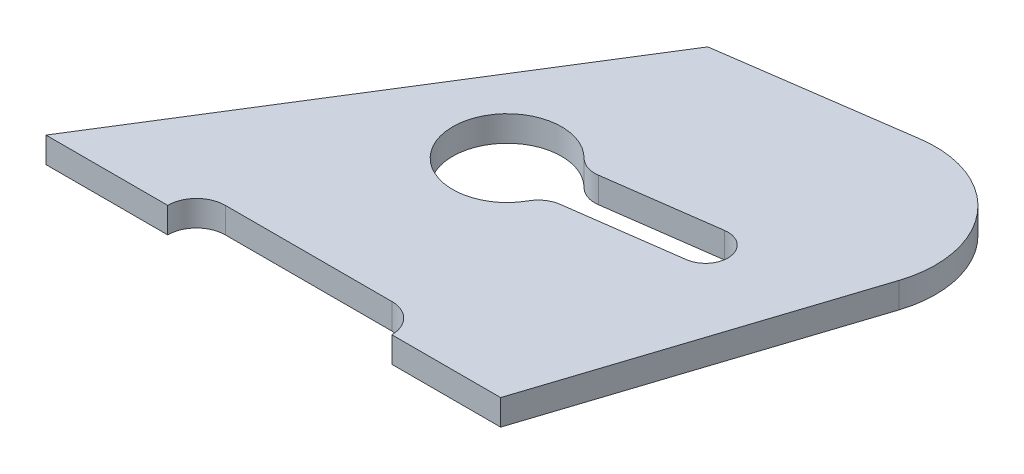
ISO-10303-21;
HEADER;
FILE_DESCRIPTION(('STEP AP214'),'2;1');
FILE_NAME('part.step','',(''),(''),'','','');
FILE_SCHEMA(('AUTOMOTIVE_DESIGN { 1 0 10303 214 1 1 1 1 }'));
ENDSEC;
DATA;
#1=APPLICATION_CONTEXT('core data for automotive mechanical design processes');
#2=APPLICATION_PROTOCOL_DEFINITION('international standard','automotive_design',2000,#1);
#3=PRODUCT_CONTEXT('',#1,'mechanical');
#4=PRODUCT('Part','Part','',(#3));
#5=PRODUCT_RELATED_PRODUCT_CATEGORY('part','',(#4));
#6=PRODUCT_DEFINITION_FORMATION('','',#4);
#7=PRODUCT_DEFINITION_CONTEXT('part definition',#1,'design');
#8=PRODUCT_DEFINITION('design','',#6,#7);
#9=PRODUCT_DEFINITION_SHAPE('','',#8);
#10=(LENGTH_UNIT() NAMED_UNIT(*) SI_UNIT(.MILLI.,.METRE.));
#11=(NAMED_UNIT(*) PLANE_ANGLE_UNIT() SI_UNIT($,.RADIAN.));
#12=(NAMED_UNIT(*) SI_UNIT($,.STERADIAN.) SOLID_ANGLE_UNIT());
#13=UNCERTAINTY_MEASURE_WITH_UNIT(LENGTH_MEASURE(1.E-05),#10,'distance_accuracy_value','');
#14=(GEOMETRIC_REPRESENTATION_CONTEXT(3) GLOBAL_UNCERTAINTY_ASSIGNED_CONTEXT((#13)) GLOBAL_UNIT_ASSIGNED_CONTEXT((#10,
#11,#12)) REPRESENTATION_CONTEXT('',''));
#15=CARTESIAN_POINT('',(0.,0.,0.));
#16=DIRECTION('',(0.,0.,1.));
#17=DIRECTION('',(1.,0.,0.));
#18=AXIS2_PLACEMENT_3D('',#15,#16,#17);
#19=CARTESIAN_POINT('',(142.06973961903,8.,-103.768811757372));
#20=DIRECTION('',(0.,1.,0.));
#21=DIRECTION('',(0.,0.,1.));
#22=AXIS2_PLACEMENT_3D('',#19,#20,#21);
#23=PLANE('',#22);
#24=DIRECTION('',(-0.529919264233203,0.,0.848048096156428));
#25=VECTOR('',#24,1.);
#26=CARTESIAN_POINT('',(0.,8.,0.));
#27=LINE('',#26,#25);
#28=CARTESIAN_POINT('',(79.4878896349804,8.,-127.207214423464));
#29=VERTEX_POINT('',#28);
#30=CARTESIAN_POINT('',(0.,8.,0.));
#31=VERTEX_POINT('',#30);
#32=EDGE_CURVE('E220',#29,#31,#27,.T.);
#33=ORIENTED_EDGE('',*,*,#32,.T.);
#34=DIRECTION('',(1.,0.,0.));
#35=VECTOR('',#34,1.);
#36=CARTESIAN_POINT('',(0.,8.,0.));
#37=LINE('',#36,#35);
#38=CARTESIAN_POINT('',(38.,8.,0.));
#39=VERTEX_POINT('',#38);
#40=EDGE_CURVE('E224',#31,#39,#37,.T.);
#41=ORIENTED_EDGE('',*,*,#40,.T.);
#42=CARTESIAN_POINT('',(47.,8.,0.));
#43=DIRECTION('',(0.,-1.,0.));
#44=DIRECTION('',(0.,0.,1.));
#45=AXIS2_PLACEMENT_3D('',#42,#43,#44);
#46=CIRCLE('',#45,9.);
#47=CARTESIAN_POINT('',(47.,8.,-9.));
#48=VERTEX_POINT('',#47);
#49=EDGE_CURVE('E228',#39,#48,#46,.T.);
#50=ORIENTED_EDGE('',*,*,#49,.T.);
#51=DIRECTION('',(1.,0.,0.));
#52=VECTOR('',#51,1.);
#53=CARTESIAN_POINT('',(47.,8.,-9.));
#54=LINE('',#53,#52);
#55=CARTESIAN_POINT('',(99.,8.,-9.));
#56=VERTEX_POINT('',#55);
#57=EDGE_CURVE('E231',#48,#56,#54,.T.);
#58=ORIENTED_EDGE('',*,*,#57,.T.);
#59=CARTESIAN_POINT('',(99.,8.,0.));
#60=DIRECTION('',(0.,-1.,0.));
#61=DIRECTION('',(0.,0.,1.));
#62=AXIS2_PLACEMENT_3D('',#59,#60,#61);
#63=CIRCLE('',#62,9.);
#64=CARTESIAN_POINT('',(108.,8.,0.));
#65=VERTEX_POINT('',#64);
#66=EDGE_CURVE('E234',#56,#65,#63,.T.);
#67=ORIENTED_EDGE('',*,*,#66,.T.);
#68=DIRECTION('',(1.,0.,0.));
#69=VECTOR('',#68,1.);
#70=CARTESIAN_POINT('',(108.,8.,0.));
#71=LINE('',#70,#69);
#72=CARTESIAN_POINT('',(142.,8.,0.));
#73=VERTEX_POINT('',#72);
#74=EDGE_CURVE('E237',#65,#73,#71,.T.);
#75=ORIENTED_EDGE('',*,*,#74,.T.);
#76=DIRECTION('',(0.309016994374945,0.,-0.951056516295154));
#77=VECTOR('',#76,1.);
#78=CARTESIAN_POINT('',(142.,8.,0.));
#79=LINE('',#78,#77);
#80=CARTESIAN_POINT('',(172.503548140475,8.,-93.8802679373735));
#81=VERTEX_POINT('',#80);
#82=EDGE_CURVE('E240',#73,#81,#79,.T.);
#83=ORIENTED_EDGE('',*,*,#82,.T.);
#84=CARTESIAN_POINT('',(142.06973961903,8.,-103.768811757372));
#85=DIRECTION('',(0.,1.,0.));
#86=DIRECTION('',(0.,0.,1.));
#87=AXIS2_PLACEMENT_3D('',#84,#85,#86);
#88=CIRCLE('',#87,32.);
#89=CARTESIAN_POINT('',(137.573015723534,8.,-135.451290735629));
#90=VERTEX_POINT('',#89);
#91=EDGE_CURVE('E243',#81,#90,#88,.T.);
#92=ORIENTED_EDGE('',*,*,#91,.T.);
#93=DIRECTION('',(-0.990077468070521,0.,0.140522621734251));
#94=VECTOR('',#93,1.);
#95=CARTESIAN_POINT('',(79.4878896349804,8.,-127.207214423464));
#96=LINE('',#95,#94);
#97=EDGE_CURVE('E246',#90,#29,#96,.T.);
#98=ORIENTED_EDGE('',*,*,#97,.T.);
#99=EDGE_LOOP('',(#33,#41,#50,#58,#67,#75,#83,#92,#98));
#100=FACE_BOUND('',#99,.T.);
#101=CARTESIAN_POINT('',(78.244657268759,8.,-65.7777382278788));
#102=DIRECTION('',(0.,1.,0.));
#103=DIRECTION('',(0.,0.,1.));
#104=AXIS2_PLACEMENT_3D('',#101,#102,#103);
#105=CIRCLE('',#104,17.);
#106=CARTESIAN_POINT('',(90.3339450400678,8.,-77.7296887457852));
#107=VERTEX_POINT('',#106);
#108=CARTESIAN_POINT('',(93.1035303419156,8.,-57.5185681124362));
#109=VERTEX_POINT('',#108);
#110=EDGE_CURVE('E160',#107,#109,#105,.T.);
#111=ORIENTED_EDGE('',*,*,#110,.F.);
#112=CARTESIAN_POINT('',(96.0230216383307,8.,-83.3541360483294));
#113=DIRECTION('',(0.,-1.,0.));
#114=DIRECTION('',(0.,0.,-1.));
#115=AXIS2_PLACEMENT_3D('',#112,#113,#114);
#116=CIRCLE('',#115,7.99999999999999);
#117=CARTESIAN_POINT('',(97.1091335214083,8.,-75.4282063881925));
#118=VERTEX_POINT('',#117);
#119=EDGE_CURVE('E151',#118,#107,#116,.T.);
#120=ORIENTED_EDGE('',*,*,#119,.F.);
#121=DIRECTION('',(-0.990741207517111,0.,0.135763985384695));
#122=VECTOR('',#121,1.);
#123=CARTESIAN_POINT('',(97.1091335214083,8.,-75.4282063881925));
#124=LINE('',#123,#122);
#125=CARTESIAN_POINT('',(131.785075784507,8.,-80.1799458766568));
#126=VERTEX_POINT('',#125);
#127=EDGE_CURVE('E186',#126,#118,#124,.T.);
#128=ORIENTED_EDGE('',*,*,#127,.F.);
#129=CARTESIAN_POINT('',(132.7354236822,8.,-73.2447574240371));
#130=DIRECTION('',(0.,1.,0.));
#131=DIRECTION('',(0.,0.,1.));
#132=AXIS2_PLACEMENT_3D('',#129,#130,#131);
#133=CIRCLE('',#132,7.);
#134=CARTESIAN_POINT('',(133.685771579893,8.,-66.3095689714173));
#135=VERTEX_POINT('',#134);
#136=EDGE_CURVE('E183',#135,#126,#133,.T.);
#137=ORIENTED_EDGE('',*,*,#136,.F.);
#138=DIRECTION('',(0.990741207517112,0.,-0.135763985384694));
#139=VECTOR('',#138,1.);
#140=CARTESIAN_POINT('',(99.0098293167941,8.,-61.557829482953));
#141=LINE('',#140,#139);
#142=CARTESIAN_POINT('',(99.0098293167941,8.,-61.557829482953));
#143=VERTEX_POINT('',#142);
#144=EDGE_CURVE('E178',#143,#135,#141,.T.);
#145=ORIENTED_EDGE('',*,*,#144,.F.);
#146=CARTESIAN_POINT('',(100.095941199872,8.,-53.6318998228161));
#147=DIRECTION('',(0.,-1.,0.));
#148=DIRECTION('',(0.,0.,1.));
#149=AXIS2_PLACEMENT_3D('',#146,#147,#148);
#150=CIRCLE('',#149,8.);
#151=EDGE_CURVE('E174',#109,#143,#150,.T.);
#152=ORIENTED_EDGE('',*,*,#151,.F.);
#153=EDGE_LOOP('',(#111,#120,#128,#137,#145,#152));
#154=FACE_BOUND('',#153,.T.);
#155=ADVANCED_FACE('F43',(#100,#154),#23,.T.);
#156=CARTESIAN_POINT('',(142.06973961903,0.,-103.768811757372));
#157=DIRECTION('',(0.,1.,0.));
#158=DIRECTION('',(0.,0.,1.));
#159=AXIS2_PLACEMENT_3D('',#156,#157,#158);
#160=PLANE('',#159);
#161=DIRECTION('',(-0.529919264233203,0.,0.848048096156428));
#162=VECTOR('',#161,1.);
#163=CARTESIAN_POINT('',(0.,0.,0.));
#164=LINE('',#163,#162);
#165=CARTESIAN_POINT('',(79.4878896349804,0.,-127.207214423464));
#166=VERTEX_POINT('',#165);
#167=CARTESIAN_POINT('',(0.,0.,0.));
#168=VERTEX_POINT('',#167);
#169=EDGE_CURVE('E169',#166,#168,#164,.T.);
#170=ORIENTED_EDGE('',*,*,#169,.F.);
#171=DIRECTION('',(-0.990077468070521,0.,0.140522621734251));
#172=VECTOR('',#171,1.);
#173=CARTESIAN_POINT('',(79.4878896349804,0.,-127.207214423464));
#174=LINE('',#173,#172);
#175=CARTESIAN_POINT('',(137.573015723534,0.,-135.451290735629));
#176=VERTEX_POINT('',#175);
#177=EDGE_CURVE('E225',#176,#166,#174,.T.);
#178=ORIENTED_EDGE('',*,*,#177,.F.);
#179=CARTESIAN_POINT('',(142.06973961903,0.,-103.768811757372));
#180=DIRECTION('',(0.,1.,0.));
#181=DIRECTION('',(0.,0.,1.));
#182=AXIS2_PLACEMENT_3D('',#179,#180,#181);
#183=CIRCLE('',#182,32.);
#184=CARTESIAN_POINT('',(172.503548140475,0.,-93.8802679373735));
#185=VERTEX_POINT('',#184);
#186=EDGE_CURVE('E271',#185,#176,#183,.T.);
#187=ORIENTED_EDGE('',*,*,#186,.F.);
#188=DIRECTION('',(0.309016994374945,0.,-0.951056516295154));
#189=VECTOR('',#188,1.);
#190=CARTESIAN_POINT('',(142.,0.,0.));
#191=LINE('',#190,#189);
#192=CARTESIAN_POINT('',(142.,0.,0.));
#193=VERTEX_POINT('',#192);
#194=EDGE_CURVE('E268',#193,#185,#191,.T.);
#195=ORIENTED_EDGE('',*,*,#194,.F.);
#196=DIRECTION('',(1.,0.,0.));
#197=VECTOR('',#196,1.);
#198=CARTESIAN_POINT('',(108.,0.,0.));
#199=LINE('',#198,#197);
#200=CARTESIAN_POINT('',(108.,0.,0.));
#201=VERTEX_POINT('',#200);
#202=EDGE_CURVE('E265',#201,#193,#199,.T.);
#203=ORIENTED_EDGE('',*,*,#202,.F.);
#204=CARTESIAN_POINT('',(99.,0.,0.));
#205=DIRECTION('',(0.,-1.,0.));
#206=DIRECTION('',(0.,0.,1.));
#207=AXIS2_PLACEMENT_3D('',#204,#205,#206);
#208=CIRCLE('',#207,9.);
#209=CARTESIAN_POINT('',(99.,0.,-9.));
#210=VERTEX_POINT('',#209);
#211=EDGE_CURVE('E262',#210,#201,#208,.T.);
#212=ORIENTED_EDGE('',*,*,#211,.F.);
#213=DIRECTION('',(1.,0.,0.));
#214=VECTOR('',#213,1.);
#215=CARTESIAN_POINT('',(47.,0.,-9.));
#216=LINE('',#215,#214);
#217=CARTESIAN_POINT('',(47.,0.,-9.));
#218=VERTEX_POINT('',#217);
#219=EDGE_CURVE('E259',#218,#210,#216,.T.);
#220=ORIENTED_EDGE('',*,*,#219,.F.);
#221=CARTESIAN_POINT('',(47.,0.,0.));
#222=DIRECTION('',(0.,-1.,0.));
#223=DIRECTION('',(0.,0.,1.));
#224=AXIS2_PLACEMENT_3D('',#221,#222,#223);
#225=CIRCLE('',#224,9.);
#226=CARTESIAN_POINT('',(38.,0.,0.));
#227=VERTEX_POINT('',#226);
#228=EDGE_CURVE('E256',#227,#218,#225,.T.);
#229=ORIENTED_EDGE('',*,*,#228,.F.);
#230=DIRECTION('',(1.,0.,0.));
#231=VECTOR('',#230,1.);
#232=CARTESIAN_POINT('',(0.,0.,0.));
#233=LINE('',#232,#231);
#234=EDGE_CURVE('E253',#168,#227,#233,.T.);
#235=ORIENTED_EDGE('',*,*,#234,.F.);
#236=EDGE_LOOP('',(#170,#178,#187,#195,#203,#212,#220,#229,#235));
#237=FACE_BOUND('',#236,.T.);
#238=CARTESIAN_POINT('',(96.0230216383307,0.,-83.3541360483294));
#239=DIRECTION('',(0.,-1.,0.));
#240=DIRECTION('',(0.,0.,-1.));
#241=AXIS2_PLACEMENT_3D('',#238,#239,#240);
#242=CIRCLE('',#241,7.99999999999999);
#243=CARTESIAN_POINT('',(97.1091335214083,0.,-75.4282063881925));
#244=VERTEX_POINT('',#243);
#245=CARTESIAN_POINT('',(90.3339450400678,0.,-77.7296887457852));
#246=VERTEX_POINT('',#245);
#247=EDGE_CURVE('E67',#244,#246,#242,.T.);
#248=ORIENTED_EDGE('',*,*,#247,.T.);
#249=CARTESIAN_POINT('',(78.244657268759,0.,-65.7777382278788));
#250=DIRECTION('',(0.,1.,0.));
#251=DIRECTION('',(0.,0.,1.));
#252=AXIS2_PLACEMENT_3D('',#249,#250,#251);
#253=CIRCLE('',#252,17.);
#254=CARTESIAN_POINT('',(93.1035303419156,0.,-57.5185681124362));
#255=VERTEX_POINT('',#254);
#256=EDGE_CURVE('E167',#246,#255,#253,.T.);
#257=ORIENTED_EDGE('',*,*,#256,.T.);
#258=CARTESIAN_POINT('',(100.095941199872,0.,-53.6318998228161));
#259=DIRECTION('',(0.,-1.,0.));
#260=DIRECTION('',(0.,0.,1.));
#261=AXIS2_PLACEMENT_3D('',#258,#259,#260);
#262=CIRCLE('',#261,8.);
#263=CARTESIAN_POINT('',(99.0098293167941,0.,-61.557829482953));
#264=VERTEX_POINT('',#263);
#265=EDGE_CURVE('E193',#255,#264,#262,.T.);
#266=ORIENTED_EDGE('',*,*,#265,.T.);
#267=DIRECTION('',(0.990741207517112,0.,-0.135763985384694));
#268=VECTOR('',#267,1.);
#269=CARTESIAN_POINT('',(99.0098293167941,0.,-61.557829482953));
#270=LINE('',#269,#268);
#271=CARTESIAN_POINT('',(133.685771579893,0.,-66.3095689714173));
#272=VERTEX_POINT('',#271);
#273=EDGE_CURVE('E197',#264,#272,#270,.T.);
#274=ORIENTED_EDGE('',*,*,#273,.T.);
#275=CARTESIAN_POINT('',(132.7354236822,0.,-73.2447574240371));
#276=DIRECTION('',(0.,1.,0.));
#277=DIRECTION('',(0.,0.,1.));
#278=AXIS2_PLACEMENT_3D('',#275,#276,#277);
#279=CIRCLE('',#278,7.);
#280=CARTESIAN_POINT('',(131.785075784507,0.,-80.1799458766568));
#281=VERTEX_POINT('',#280);
#282=EDGE_CURVE('E201',#272,#281,#279,.T.);
#283=ORIENTED_EDGE('',*,*,#282,.T.);
#284=DIRECTION('',(-0.990741207517111,0.,0.135763985384695));
#285=VECTOR('',#284,1.);
#286=CARTESIAN_POINT('',(97.1091335214083,0.,-75.4282063881925));
#287=LINE('',#286,#285);
#288=EDGE_CURVE('E161',#281,#244,#287,.T.);
#289=ORIENTED_EDGE('',*,*,#288,.T.);
#290=EDGE_LOOP('',(#248,#257,#266,#274,#283,#289));
#291=FACE_BOUND('',#290,.T.);
#292=ADVANCED_FACE('F314',(#237,#291),#160,.F.);
#293=CARTESIAN_POINT('',(0.,8.,0.));
#294=DIRECTION('',(0.848048096156428,0.,0.529919264233203));
#295=DIRECTION('',(0.529919264233203,0.,-0.848048096156428));
#296=AXIS2_PLACEMENT_3D('',#293,#294,#295);
#297=PLANE('',#296);
#298=ORIENTED_EDGE('',*,*,#169,.T.);
#299=DIRECTION('',(0.,-1.,0.));
#300=VECTOR('',#299,1.);
#301=CARTESIAN_POINT('',(0.,8.,0.));
#302=LINE('',#301,#300);
#303=EDGE_CURVE('E11',#31,#168,#302,.T.);
#304=ORIENTED_EDGE('',*,*,#303,.F.);
#305=ORIENTED_EDGE('',*,*,#32,.F.);
#306=DIRECTION('',(0.,-1.,0.));
#307=VECTOR('',#306,1.);
#308=CARTESIAN_POINT('',(79.4878896349804,8.,-127.207214423464));
#309=LINE('',#308,#307);
#310=EDGE_CURVE('E249',#29,#166,#309,.T.);
#311=ORIENTED_EDGE('',*,*,#310,.T.);
#312=EDGE_LOOP('',(#298,#304,#305,#311));
#313=FACE_BOUND('',#312,.T.);
#314=ADVANCED_FACE('F45',(#313),#297,.F.);
#315=CARTESIAN_POINT('',(0.,8.,0.));
#316=DIRECTION('',(0.,0.,-1.));
#317=DIRECTION('',(-1.,0.,0.));
#318=AXIS2_PLACEMENT_3D('',#315,#316,#317);
#319=PLANE('',#318);
#320=ORIENTED_EDGE('',*,*,#234,.T.);
#321=DIRECTION('',(0.,-1.,0.));
#322=VECTOR('',#321,1.);
#323=CARTESIAN_POINT('',(38.,8.,0.));
#324=LINE('',#323,#322);
#325=EDGE_CURVE('E52',#39,#227,#324,.T.);
#326=ORIENTED_EDGE('',*,*,#325,.F.);
#327=ORIENTED_EDGE('',*,*,#40,.F.);
#328=ORIENTED_EDGE('',*,*,#303,.T.);
#329=EDGE_LOOP('',(#320,#326,#327,#328));
#330=FACE_BOUND('',#329,.T.);
#331=ADVANCED_FACE('F331',(#330),#319,.F.);
#332=CARTESIAN_POINT('',(47.,8.,0.));
#333=DIRECTION('',(0.,-1.,0.));
#334=DIRECTION('',(0.,0.,-1.));
#335=AXIS2_PLACEMENT_3D('',#332,#333,#334);
#336=CYLINDRICAL_SURFACE('',#335,9.);
#337=ORIENTED_EDGE('',*,*,#228,.T.);
#338=DIRECTION('',(0.,-1.,0.));
#339=VECTOR('',#338,1.);
#340=CARTESIAN_POINT('',(47.,8.,-9.));
#341=LINE('',#340,#339);
#342=EDGE_CURVE('E299',#48,#218,#341,.T.);
#343=ORIENTED_EDGE('',*,*,#342,.F.);
#344=ORIENTED_EDGE('',*,*,#49,.F.);
#345=ORIENTED_EDGE('',*,*,#325,.T.);
#346=EDGE_LOOP('',(#337,#343,#344,#345));
#347=FACE_BOUND('',#346,.T.);
#348=ADVANCED_FACE('F308',(#347),#336,.F.);
#349=CARTESIAN_POINT('',(47.,8.,-9.));
#350=DIRECTION('',(0.,0.,-1.));
#351=DIRECTION('',(-1.,0.,0.));
#352=AXIS2_PLACEMENT_3D('',#349,#350,#351);
#353=PLANE('',#352);
#354=ORIENTED_EDGE('',*,*,#219,.T.);
#355=DIRECTION('',(0.,-1.,0.));
#356=VECTOR('',#355,1.);
#357=CARTESIAN_POINT('',(99.,8.,-9.));
#358=LINE('',#357,#356);
#359=EDGE_CURVE('E295',#56,#210,#358,.T.);
#360=ORIENTED_EDGE('',*,*,#359,.F.);
#361=ORIENTED_EDGE('',*,*,#57,.F.);
#362=ORIENTED_EDGE('',*,*,#342,.T.);
#363=EDGE_LOOP('',(#354,#360,#361,#362));
#364=FACE_BOUND('',#363,.T.);
#365=ADVANCED_FACE('F320',(#364),#353,.F.);
#366=CARTESIAN_POINT('',(99.,8.,0.));
#367=DIRECTION('',(0.,-1.,0.));
#368=DIRECTION('',(0.,0.,-1.));
#369=AXIS2_PLACEMENT_3D('',#366,#367,#368);
#370=CYLINDRICAL_SURFACE('',#369,9.);
#371=ORIENTED_EDGE('',*,*,#211,.T.);
#372=DIRECTION('',(0.,-1.,0.));
#373=VECTOR('',#372,1.);
#374=CARTESIAN_POINT('',(108.,8.,0.));
#375=LINE('',#374,#373);
#376=EDGE_CURVE('E291',#65,#201,#375,.T.);
#377=ORIENTED_EDGE('',*,*,#376,.F.);
#378=ORIENTED_EDGE('',*,*,#66,.F.);
#379=ORIENTED_EDGE('',*,*,#359,.T.);
#380=EDGE_LOOP('',(#371,#377,#378,#379));
#381=FACE_BOUND('',#380,.T.);
#382=ADVANCED_FACE('F324',(#381),#370,.F.);
#383=CARTESIAN_POINT('',(108.,8.,0.));
#384=DIRECTION('',(0.,0.,-1.));
#385=DIRECTION('',(-1.,0.,0.));
#386=AXIS2_PLACEMENT_3D('',#383,#384,#385);
#387=PLANE('',#386);
#388=ORIENTED_EDGE('',*,*,#202,.T.);
#389=DIRECTION('',(0.,-1.,0.));
#390=VECTOR('',#389,1.);
#391=CARTESIAN_POINT('',(142.,8.,0.));
#392=LINE('',#391,#390);
#393=EDGE_CURVE('E287',#73,#193,#392,.T.);
#394=ORIENTED_EDGE('',*,*,#393,.F.);
#395=ORIENTED_EDGE('',*,*,#74,.F.);
#396=ORIENTED_EDGE('',*,*,#376,.T.);
#397=EDGE_LOOP('',(#388,#394,#395,#396));
#398=FACE_BOUND('',#397,.T.);
#399=ADVANCED_FACE('F349',(#398),#387,.F.);
#400=CARTESIAN_POINT('',(142.,8.,0.));
#401=DIRECTION('',(-0.951056516295154,0.,-0.309016994374945));
#402=DIRECTION('',(-0.309016994374945,0.,0.951056516295155));
#403=AXIS2_PLACEMENT_3D('',#400,#401,#402);
#404=PLANE('',#403);
#405=ORIENTED_EDGE('',*,*,#194,.T.);
#406=DIRECTION('',(0.,-1.,0.));
#407=VECTOR('',#406,1.);
#408=CARTESIAN_POINT('',(172.503548140475,8.,-93.8802679373735));
#409=LINE('',#408,#407);
#410=EDGE_CURVE('E283',#81,#185,#409,.T.);
#411=ORIENTED_EDGE('',*,*,#410,.F.);
#412=ORIENTED_EDGE('',*,*,#82,.F.);
#413=ORIENTED_EDGE('',*,*,#393,.T.);
#414=EDGE_LOOP('',(#405,#411,#412,#413));
#415=FACE_BOUND('',#414,.T.);
#416=ADVANCED_FACE('F347',(#415),#404,.F.);
#417=CARTESIAN_POINT('',(142.06973961903,8.,-103.768811757372));
#418=DIRECTION('',(0.,-1.,0.));
#419=DIRECTION('',(0.,0.,-1.));
#420=AXIS2_PLACEMENT_3D('',#417,#418,#419);
#421=CYLINDRICAL_SURFACE('',#420,32.);
#422=ORIENTED_EDGE('',*,*,#186,.T.);
#423=DIRECTION('',(0.,-1.,0.));
#424=VECTOR('',#423,1.);
#425=CARTESIAN_POINT('',(137.573015723534,8.,-135.451290735629));
#426=LINE('',#425,#424);
#427=EDGE_CURVE('E279',#90,#176,#426,.T.);
#428=ORIENTED_EDGE('',*,*,#427,.F.);
#429=ORIENTED_EDGE('',*,*,#91,.F.);
#430=ORIENTED_EDGE('',*,*,#410,.T.);
#431=EDGE_LOOP('',(#422,#428,#429,#430));
#432=FACE_BOUND('',#431,.T.);
#433=ADVANCED_FACE('F343',(#432),#421,.T.);
#434=CARTESIAN_POINT('',(79.4878896349804,8.,-127.207214423464));
#435=DIRECTION('',(0.140522621734251,0.,0.990077468070521));
#436=DIRECTION('',(0.990077468070521,0.,-0.140522621734251));
#437=AXIS2_PLACEMENT_3D('',#434,#435,#436);
#438=PLANE('',#437);
#439=ORIENTED_EDGE('',*,*,#177,.T.);
#440=ORIENTED_EDGE('',*,*,#310,.F.);
#441=ORIENTED_EDGE('',*,*,#97,.F.);
#442=ORIENTED_EDGE('',*,*,#427,.T.);
#443=EDGE_LOOP('',(#439,#440,#441,#442));
#444=FACE_BOUND('',#443,.T.);
#445=ADVANCED_FACE('F338',(#444),#438,.F.);
#446=CARTESIAN_POINT('',(96.0230216383307,8.,-83.3541360483294));
#447=DIRECTION('',(0.,-1.,0.));
#448=DIRECTION('',(0.,0.,-1.));
#449=AXIS2_PLACEMENT_3D('',#446,#447,#448);
#450=CYLINDRICAL_SURFACE('',#449,7.99999999999999);
#451=ORIENTED_EDGE('',*,*,#247,.F.);
#452=DIRECTION('',(0.,-1.,0.));
#453=VECTOR('',#452,1.);
#454=CARTESIAN_POINT('',(97.1091335214083,8.,-75.4282063881925));
#455=LINE('',#454,#453);
#456=EDGE_CURVE('E155',#118,#244,#455,.T.);
#457=ORIENTED_EDGE('',*,*,#456,.F.);
#458=ORIENTED_EDGE('',*,*,#119,.T.);
#459=DIRECTION('',(0.,-1.,0.));
#460=VECTOR('',#459,1.);
#461=CARTESIAN_POINT('',(90.3339450400678,8.,-77.7296887457852));
#462=LINE('',#461,#460);
#463=EDGE_CURVE('E154',#107,#246,#462,.T.);
#464=ORIENTED_EDGE('',*,*,#463,.T.);
#465=EDGE_LOOP('',(#451,#457,#458,#464));
#466=FACE_BOUND('',#465,.T.);
#467=ADVANCED_FACE('F153',(#466),#450,.T.);
#468=CARTESIAN_POINT('',(78.244657268759,8.,-65.7777382278788));
#469=DIRECTION('',(0.,-1.,0.));
#470=DIRECTION('',(0.,0.,-1.));
#471=AXIS2_PLACEMENT_3D('',#468,#469,#470);
#472=CYLINDRICAL_SURFACE('',#471,17.);
#473=ORIENTED_EDGE('',*,*,#256,.F.);
#474=ORIENTED_EDGE('',*,*,#463,.F.);
#475=ORIENTED_EDGE('',*,*,#110,.T.);
#476=DIRECTION('',(0.,-1.,0.));
#477=VECTOR('',#476,1.);
#478=CARTESIAN_POINT('',(93.1035303419156,8.,-57.5185681124362));
#479=LINE('',#478,#477);
#480=EDGE_CURVE('E170',#109,#255,#479,.T.);
#481=ORIENTED_EDGE('',*,*,#480,.T.);
#482=EDGE_LOOP('',(#473,#474,#475,#481));
#483=FACE_BOUND('',#482,.T.);
#484=ADVANCED_FACE('F164',(#483),#472,.F.);
#485=CARTESIAN_POINT('',(100.095941199872,8.,-53.6318998228161));
#486=DIRECTION('',(0.,-1.,0.));
#487=DIRECTION('',(0.,0.,-1.));
#488=AXIS2_PLACEMENT_3D('',#485,#486,#487);
#489=CYLINDRICAL_SURFACE('',#488,8.);
#490=ORIENTED_EDGE('',*,*,#265,.F.);
#491=ORIENTED_EDGE('',*,*,#480,.F.);
#492=ORIENTED_EDGE('',*,*,#151,.T.);
#493=DIRECTION('',(0.,-1.,0.));
#494=VECTOR('',#493,1.);
#495=CARTESIAN_POINT('',(99.0098293167941,8.,-61.557829482953));
#496=LINE('',#495,#494);
#497=EDGE_CURVE('E215',#143,#264,#496,.T.);
#498=ORIENTED_EDGE('',*,*,#497,.T.);
#499=EDGE_LOOP('',(#490,#491,#492,#498));
#500=FACE_BOUND('',#499,.T.);
#501=ADVANCED_FACE('F389',(#500),#489,.T.);
#502=CARTESIAN_POINT('',(99.0098293167941,8.,-61.557829482953));
#503=DIRECTION('',(-0.135763985384694,0.,-0.990741207517112));
#504=DIRECTION('',(-0.990741207517112,0.,0.135763985384694));
#505=AXIS2_PLACEMENT_3D('',#502,#503,#504);
#506=PLANE('',#505);
#507=ORIENTED_EDGE('',*,*,#273,.F.);
#508=ORIENTED_EDGE('',*,*,#497,.F.);
#509=ORIENTED_EDGE('',*,*,#144,.T.);
#510=DIRECTION('',(0.,-1.,0.));
#511=VECTOR('',#510,1.);
#512=CARTESIAN_POINT('',(133.685771579893,8.,-66.3095689714173));
#513=LINE('',#512,#511);
#514=EDGE_CURVE('E212',#135,#272,#513,.T.);
#515=ORIENTED_EDGE('',*,*,#514,.T.);
#516=EDGE_LOOP('',(#507,#508,#509,#515));
#517=FACE_BOUND('',#516,.T.);
#518=ADVANCED_FACE('F395',(#517),#506,.T.);
#519=CARTESIAN_POINT('',(132.7354236822,8.,-73.2447574240371));
#520=DIRECTION('',(0.,-1.,0.));
#521=DIRECTION('',(0.,0.,-1.));
#522=AXIS2_PLACEMENT_3D('',#519,#520,#521);
#523=CYLINDRICAL_SURFACE('',#522,7.);
#524=ORIENTED_EDGE('',*,*,#282,.F.);
#525=ORIENTED_EDGE('',*,*,#514,.F.);
#526=ORIENTED_EDGE('',*,*,#136,.T.);
#527=DIRECTION('',(0.,-1.,0.));
#528=VECTOR('',#527,1.);
#529=CARTESIAN_POINT('',(131.785075784507,8.,-80.1799458766568));
#530=LINE('',#529,#528);
#531=EDGE_CURVE('E59',#126,#281,#530,.T.);
#532=ORIENTED_EDGE('',*,*,#531,.T.);
#533=EDGE_LOOP('',(#524,#525,#526,#532));
#534=FACE_BOUND('',#533,.T.);
#535=ADVANCED_FACE('F403',(#534),#523,.F.);
#536=CARTESIAN_POINT('',(97.1091335214083,8.,-75.4282063881925));
#537=DIRECTION('',(0.135763985384695,0.,0.990741207517112));
#538=DIRECTION('',(0.990741207517112,0.,-0.135763985384695));
#539=AXIS2_PLACEMENT_3D('',#536,#537,#538);
#540=PLANE('',#539);
#541=ORIENTED_EDGE('',*,*,#288,.F.);
#542=ORIENTED_EDGE('',*,*,#531,.F.);
#543=ORIENTED_EDGE('',*,*,#127,.T.);
#544=ORIENTED_EDGE('',*,*,#456,.T.);
#545=EDGE_LOOP('',(#541,#542,#543,#544));
#546=FACE_BOUND('',#545,.T.);
#547=ADVANCED_FACE('F411',(#546),#540,.T.);
#548=CLOSED_SHELL('',(#155,#292,#314,#331,#348,#365,#382,#399,#416,#433,#445,#467,#484,#501,
#518,#535,#547));
#549=MANIFOLD_SOLID_BREP('B2',#548);
#550=ADVANCED_BREP_SHAPE_REPRESENTATION('',(#18,#549),#14);
#551=SHAPE_DEFINITION_REPRESENTATION(#9,#550);
ENDSEC;
END-ISO-10303-21;
